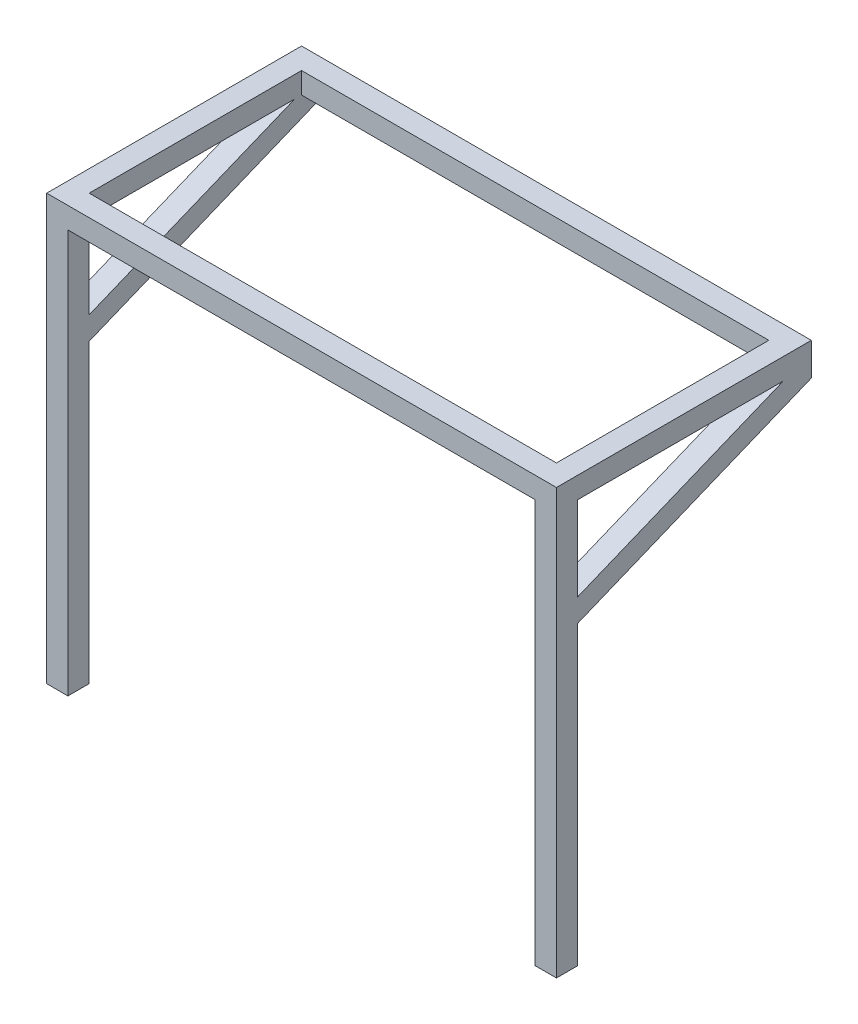
ISO-10303-21;
HEADER;
FILE_DESCRIPTION(('STEP AP214'),'2;1');
FILE_NAME('part.step','',(''),(''),'','','');
FILE_SCHEMA(('AUTOMOTIVE_DESIGN { 1 0 10303 214 1 1 1 1 }'));
ENDSEC;
DATA;
#1=APPLICATION_CONTEXT('core data for automotive mechanical design processes');
#2=APPLICATION_PROTOCOL_DEFINITION('international standard','automotive_design',2000,#1);
#3=PRODUCT_CONTEXT('',#1,'mechanical');
#4=PRODUCT('Part','Part','',(#3));
#5=PRODUCT_RELATED_PRODUCT_CATEGORY('part','',(#4));
#6=PRODUCT_DEFINITION_FORMATION('','',#4);
#7=PRODUCT_DEFINITION_CONTEXT('part definition',#1,'design');
#8=PRODUCT_DEFINITION('design','',#6,#7);
#9=PRODUCT_DEFINITION_SHAPE('','',#8);
#10=(LENGTH_UNIT() NAMED_UNIT(*) SI_UNIT(.MILLI.,.METRE.));
#11=(NAMED_UNIT(*) PLANE_ANGLE_UNIT() SI_UNIT($,.RADIAN.));
#12=(NAMED_UNIT(*) SI_UNIT($,.STERADIAN.) SOLID_ANGLE_UNIT());
#13=UNCERTAINTY_MEASURE_WITH_UNIT(LENGTH_MEASURE(1.E-05),#10,'distance_accuracy_value','');
#14=(GEOMETRIC_REPRESENTATION_CONTEXT(3) GLOBAL_UNCERTAINTY_ASSIGNED_CONTEXT((#13)) GLOBAL_UNIT_ASSIGNED_CONTEXT((#10,
#11,#12)) REPRESENTATION_CONTEXT('',''));
#15=CARTESIAN_POINT('',(0.,0.,0.));
#16=DIRECTION('',(0.,0.,1.));
#17=DIRECTION('',(1.,0.,0.));
#18=AXIS2_PLACEMENT_3D('',#15,#16,#17);
#19=CARTESIAN_POINT('',(0.,228.6,0.));
#20=DIRECTION('',(0.,1.,0.));
#21=DIRECTION('',(0.,0.,1.));
#22=AXIS2_PLACEMENT_3D('',#19,#20,#21);
#23=PLANE('',#22);
#24=DIRECTION('',(0.,0.,-1.));
#25=VECTOR('',#24,1.);
#26=CARTESIAN_POINT('',(0.,228.6,0.));
#27=LINE('',#26,#25);
#28=CARTESIAN_POINT('',(0.,228.6,-25.3999999999999));
#29=VERTEX_POINT('',#28);
#30=CARTESIAN_POINT('',(0.,228.6,-271.258271796698));
#31=VERTEX_POINT('',#30);
#32=EDGE_CURVE('E94',#29,#31,#27,.T.);
#33=ORIENTED_EDGE('',*,*,#32,.T.);
#34=DIRECTION('',(-1.,0.,0.));
#35=VECTOR('',#34,1.);
#36=CARTESIAN_POINT('',(25.4,228.6,-271.258271796698));
#37=LINE('',#36,#35);
#38=CARTESIAN_POINT('',(25.4,228.6,-271.258271796698));
#39=VERTEX_POINT('',#38);
#40=EDGE_CURVE('E250',#39,#31,#37,.T.);
#41=ORIENTED_EDGE('',*,*,#40,.F.);
#42=DIRECTION('',(0.,0.,-1.));
#43=VECTOR('',#42,1.);
#44=CARTESIAN_POINT('',(25.4,228.6,0.));
#45=LINE('',#44,#43);
#46=CARTESIAN_POINT('',(25.4,228.6,-25.3999999999999));
#47=VERTEX_POINT('',#46);
#48=EDGE_CURVE('E307',#47,#39,#45,.T.);
#49=ORIENTED_EDGE('',*,*,#48,.F.);
#50=DIRECTION('',(-1.,0.,0.));
#51=VECTOR('',#50,1.);
#52=CARTESIAN_POINT('',(0.,228.6,-25.3999999999999));
#53=LINE('',#52,#51);
#54=EDGE_CURVE('E310',#47,#29,#53,.T.);
#55=ORIENTED_EDGE('',*,*,#54,.T.);
#56=EDGE_LOOP('',(#33,#41,#49,#55));
#57=FACE_BOUND('',#56,.T.);
#58=ADVANCED_FACE('F71',(#57),#23,.F.);
#59=CARTESIAN_POINT('',(0.,254.,-25.3999999999999));
#60=DIRECTION('',(0.,0.,-1.));
#61=DIRECTION('',(-1.,0.,0.));
#62=AXIS2_PLACEMENT_3D('',#59,#60,#61);
#63=PLANE('',#62);
#64=DIRECTION('',(-1.,0.,0.));
#65=VECTOR('',#64,1.);
#66=CARTESIAN_POINT('',(25.4,128.021616083169,-25.4));
#67=LINE('',#66,#65);
#68=CARTESIAN_POINT('',(25.4,128.021616083169,-25.4));
#69=VERTEX_POINT('',#68);
#70=CARTESIAN_POINT('',(0.,128.021616083169,-25.4));
#71=VERTEX_POINT('',#70);
#72=EDGE_CURVE('E253',#69,#71,#67,.T.);
#73=ORIENTED_EDGE('',*,*,#72,.T.);
#74=DIRECTION('',(0.,-1.,0.));
#75=VECTOR('',#74,1.);
#76=CARTESIAN_POINT('',(0.,254.,-25.3999999999999));
#77=LINE('',#76,#75);
#78=EDGE_CURVE('E381',#29,#71,#77,.T.);
#79=ORIENTED_EDGE('',*,*,#78,.F.);
#80=ORIENTED_EDGE('',*,*,#54,.F.);
#81=DIRECTION('',(0.,-1.,0.));
#82=VECTOR('',#81,1.);
#83=CARTESIAN_POINT('',(25.4,254.,-25.3999999999999));
#84=LINE('',#83,#82);
#85=EDGE_CURVE('E385',#47,#69,#84,.T.);
#86=ORIENTED_EDGE('',*,*,#85,.T.);
#87=EDGE_LOOP('',(#73,#79,#80,#86));
#88=FACE_BOUND('',#87,.T.);
#89=ADVANCED_FACE('F439',(#88),#63,.T.);
#90=DIRECTION('',(0.,-1.,0.));
#91=VECTOR('',#90,1.);
#92=CARTESIAN_POINT('',(609.6,254.,-25.4));
#93=LINE('',#92,#91);
#94=CARTESIAN_POINT('',(609.6,228.6,-25.3999999999999));
#95=VERTEX_POINT('',#94);
#96=CARTESIAN_POINT('',(609.6,128.021616083169,-25.4));
#97=VERTEX_POINT('',#96);
#98=EDGE_CURVE('E341',#95,#97,#93,.T.);
#99=ORIENTED_EDGE('',*,*,#98,.T.);
#100=DIRECTION('',(1.,0.,0.));
#101=VECTOR('',#100,1.);
#102=CARTESIAN_POINT('',(584.2,128.021616083169,-25.4));
#103=LINE('',#102,#101);
#104=CARTESIAN_POINT('',(584.2,128.021616083169,-25.4));
#105=VERTEX_POINT('',#104);
#106=EDGE_CURVE('E277',#105,#97,#103,.T.);
#107=ORIENTED_EDGE('',*,*,#106,.F.);
#108=DIRECTION('',(0.,-1.,0.));
#109=VECTOR('',#108,1.);
#110=CARTESIAN_POINT('',(584.2,254.,-25.4));
#111=LINE('',#110,#109);
#112=CARTESIAN_POINT('',(584.2,228.6,-25.4));
#113=VERTEX_POINT('',#112);
#114=EDGE_CURVE('E337',#113,#105,#111,.T.);
#115=ORIENTED_EDGE('',*,*,#114,.F.);
#116=DIRECTION('',(1.,0.,0.));
#117=VECTOR('',#116,1.);
#118=CARTESIAN_POINT('',(0.,228.6,-25.3999999999999));
#119=LINE('',#118,#117);
#120=EDGE_CURVE('E315',#113,#95,#119,.T.);
#121=ORIENTED_EDGE('',*,*,#120,.T.);
#122=EDGE_LOOP('',(#99,#107,#115,#121));
#123=FACE_BOUND('',#122,.T.);
#124=ADVANCED_FACE('F455',(#123),#63,.T.);
#125=DIRECTION('',(1.,0.,0.));
#126=VECTOR('',#125,1.);
#127=CARTESIAN_POINT('',(584.2,228.6,-271.258271796698));
#128=LINE('',#127,#126);
#129=CARTESIAN_POINT('',(584.2,228.6,-271.258271796698));
#130=VERTEX_POINT('',#129);
#131=CARTESIAN_POINT('',(609.6,228.6,-271.258271796698));
#132=VERTEX_POINT('',#131);
#133=EDGE_CURVE('E266',#130,#132,#128,.T.);
#134=ORIENTED_EDGE('',*,*,#133,.T.);
#135=DIRECTION('',(0.,0.,-1.));
#136=VECTOR('',#135,1.);
#137=CARTESIAN_POINT('',(609.6,228.6,0.));
#138=LINE('',#137,#136);
#139=EDGE_CURVE('E225',#95,#132,#138,.T.);
#140=ORIENTED_EDGE('',*,*,#139,.F.);
#141=ORIENTED_EDGE('',*,*,#120,.F.);
#142=DIRECTION('',(0.,0.,-1.));
#143=VECTOR('',#142,1.);
#144=CARTESIAN_POINT('',(584.2,228.6,0.));
#145=LINE('',#144,#143);
#146=EDGE_CURVE('E297',#113,#130,#145,.T.);
#147=ORIENTED_EDGE('',*,*,#146,.T.);
#148=EDGE_LOOP('',(#134,#140,#141,#147));
#149=FACE_BOUND('',#148,.T.);
#150=ADVANCED_FACE('F451',(#149),#23,.F.);
#151=DIRECTION('',(1.,0.,0.));
#152=VECTOR('',#151,1.);
#153=CARTESIAN_POINT('',(0.,228.6,-279.4));
#154=LINE('',#153,#152);
#155=CARTESIAN_POINT('',(25.4,228.6,-279.4));
#156=VERTEX_POINT('',#155);
#157=CARTESIAN_POINT('',(584.2,228.6,-279.4));
#158=VERTEX_POINT('',#157);
#159=EDGE_CURVE('E232',#156,#158,#154,.T.);
#160=ORIENTED_EDGE('',*,*,#159,.F.);
#161=DIRECTION('',(0.,0.,-1.));
#162=VECTOR('',#161,1.);
#163=CARTESIAN_POINT('',(25.4,228.6,-304.8));
#164=LINE('',#163,#162);
#165=CARTESIAN_POINT('',(25.4,228.6,-304.8));
#166=VERTEX_POINT('',#165);
#167=EDGE_CURVE('E229',#156,#166,#164,.T.);
#168=ORIENTED_EDGE('',*,*,#167,.T.);
#169=DIRECTION('',(1.,0.,0.));
#170=VECTOR('',#169,1.);
#171=CARTESIAN_POINT('',(0.,228.6,-304.8));
#172=LINE('',#171,#170);
#173=CARTESIAN_POINT('',(584.2,228.6,-304.8));
#174=VERTEX_POINT('',#173);
#175=EDGE_CURVE('E215',#166,#174,#172,.T.);
#176=ORIENTED_EDGE('',*,*,#175,.T.);
#177=DIRECTION('',(0.,0.,-1.));
#178=VECTOR('',#177,1.);
#179=CARTESIAN_POINT('',(584.2,228.6,0.));
#180=LINE('',#179,#178);
#181=EDGE_CURVE('E12',#158,#174,#180,.T.);
#182=ORIENTED_EDGE('',*,*,#181,.F.);
#183=EDGE_LOOP('',(#160,#168,#176,#182));
#184=FACE_BOUND('',#183,.T.);
#185=ADVANCED_FACE('F230',(#184),#23,.F.);
#186=DIRECTION('',(-1.,0.,0.));
#187=VECTOR('',#186,1.);
#188=CARTESIAN_POINT('',(25.4,100.578383916831,-25.4));
#189=LINE('',#188,#187);
#190=CARTESIAN_POINT('',(25.4,100.578383916831,-25.4));
#191=VERTEX_POINT('',#190);
#192=CARTESIAN_POINT('',(0.,100.578383916831,-25.3999999999999));
#193=VERTEX_POINT('',#192);
#194=EDGE_CURVE('E256',#191,#193,#189,.T.);
#195=ORIENTED_EDGE('',*,*,#194,.F.);
#196=CARTESIAN_POINT('',(25.4,-254.,-25.3999999999999));
#197=VERTEX_POINT('',#196);
#198=EDGE_CURVE('E384',#191,#197,#84,.T.);
#199=ORIENTED_EDGE('',*,*,#198,.T.);
#200=DIRECTION('',(1.,0.,0.));
#201=VECTOR('',#200,1.);
#202=CARTESIAN_POINT('',(0.,-254.,-25.3999999999999));
#203=LINE('',#202,#201);
#204=CARTESIAN_POINT('',(0.,-254.,-25.3999999999999));
#205=VERTEX_POINT('',#204);
#206=EDGE_CURVE('E374',#205,#197,#203,.T.);
#207=ORIENTED_EDGE('',*,*,#206,.F.);
#208=EDGE_CURVE('E380',#193,#205,#77,.T.);
#209=ORIENTED_EDGE('',*,*,#208,.F.);
#210=EDGE_LOOP('',(#195,#199,#207,#209));
#211=FACE_BOUND('',#210,.T.);
#212=ADVANCED_FACE('F405',(#211),#63,.T.);
#213=DIRECTION('',(0.,1.,0.));
#214=VECTOR('',#213,1.);
#215=CARTESIAN_POINT('',(25.4,228.6,-25.3999999999999));
#216=LINE('',#215,#214);
#217=CARTESIAN_POINT('',(25.4,254.,-25.3999999999999));
#218=VERTEX_POINT('',#217);
#219=EDGE_CURVE('E292',#47,#218,#216,.T.);
#220=ORIENTED_EDGE('',*,*,#219,.T.);
#221=DIRECTION('',(1.,0.,0.));
#222=VECTOR('',#221,1.);
#223=CARTESIAN_POINT('',(0.,254.,-25.3999999999999));
#224=LINE('',#223,#222);
#225=CARTESIAN_POINT('',(584.2,254.,-25.3999999999999));
#226=VERTEX_POINT('',#225);
#227=EDGE_CURVE('E363',#218,#226,#224,.T.);
#228=ORIENTED_EDGE('',*,*,#227,.T.);
#229=DIRECTION('',(0.,1.,0.));
#230=VECTOR('',#229,1.);
#231=CARTESIAN_POINT('',(584.2,228.6,-25.3999999999999));
#232=LINE('',#231,#230);
#233=EDGE_CURVE('E273',#113,#226,#232,.T.);
#234=ORIENTED_EDGE('',*,*,#233,.F.);
#235=DIRECTION('',(1.,0.,0.));
#236=VECTOR('',#235,1.);
#237=CARTESIAN_POINT('',(25.4,228.6,-25.4));
#238=LINE('',#237,#236);
#239=EDGE_CURVE('E348',#47,#113,#238,.T.);
#240=ORIENTED_EDGE('',*,*,#239,.F.);
#241=EDGE_LOOP('',(#220,#228,#234,#240));
#242=FACE_BOUND('',#241,.T.);
#243=ADVANCED_FACE('F433',(#242),#63,.T.);
#244=DIRECTION('',(1.,0.,0.));
#245=VECTOR('',#244,1.);
#246=CARTESIAN_POINT('',(584.2,100.578383916831,-25.4));
#247=LINE('',#246,#245);
#248=CARTESIAN_POINT('',(584.2,100.578383916831,-25.4));
#249=VERTEX_POINT('',#248);
#250=CARTESIAN_POINT('',(609.6,100.578383916831,-25.4));
#251=VERTEX_POINT('',#250);
#252=EDGE_CURVE('E274',#249,#251,#247,.T.);
#253=ORIENTED_EDGE('',*,*,#252,.T.);
#254=CARTESIAN_POINT('',(609.6,-254.,-25.4));
#255=VERTEX_POINT('',#254);
#256=EDGE_CURVE('E340',#251,#255,#93,.T.);
#257=ORIENTED_EDGE('',*,*,#256,.T.);
#258=DIRECTION('',(-1.,0.,0.));
#259=VECTOR('',#258,1.);
#260=CARTESIAN_POINT('',(0.,-254.,-25.4000000000001));
#261=LINE('',#260,#259);
#262=CARTESIAN_POINT('',(584.2,-254.,-25.4));
#263=VERTEX_POINT('',#262);
#264=EDGE_CURVE('E327',#255,#263,#261,.T.);
#265=ORIENTED_EDGE('',*,*,#264,.T.);
#266=EDGE_CURVE('E326',#249,#263,#111,.T.);
#267=ORIENTED_EDGE('',*,*,#266,.F.);
#268=EDGE_LOOP('',(#253,#257,#265,#267));
#269=FACE_BOUND('',#268,.T.);
#270=ADVANCED_FACE('F563',(#269),#63,.T.);
#271=CARTESIAN_POINT('',(25.4,254.,0.));
#272=DIRECTION('',(-1.,0.,0.));
#273=DIRECTION('',(0.,0.,1.));
#274=AXIS2_PLACEMENT_3D('',#271,#272,#273);
#275=PLANE('',#274);
#276=DIRECTION('',(0.,0.,-1.));
#277=VECTOR('',#276,1.);
#278=CARTESIAN_POINT('',(25.4,228.6,0.));
#279=LINE('',#278,#277);
#280=CARTESIAN_POINT('',(25.4,228.6,0.));
#281=VERTEX_POINT('',#280);
#282=EDGE_CURVE('E357',#281,#47,#279,.T.);
#283=ORIENTED_EDGE('',*,*,#282,.F.);
#284=DIRECTION('',(0.,-1.,0.));
#285=VECTOR('',#284,1.);
#286=CARTESIAN_POINT('',(25.4,254.,0.));
#287=LINE('',#286,#285);
#288=CARTESIAN_POINT('',(25.4,-254.,0.));
#289=VERTEX_POINT('',#288);
#290=EDGE_CURVE('E79',#281,#289,#287,.T.);
#291=ORIENTED_EDGE('',*,*,#290,.T.);
#292=DIRECTION('',(0.,0.,-1.));
#293=VECTOR('',#292,1.);
#294=CARTESIAN_POINT('',(25.4,-254.,0.));
#295=LINE('',#294,#293);
#296=EDGE_CURVE('E371',#289,#197,#295,.T.);
#297=ORIENTED_EDGE('',*,*,#296,.T.);
#298=ORIENTED_EDGE('',*,*,#198,.F.);
#299=DIRECTION('',(0.,-0.378632845720504,0.925546956205677));
#300=VECTOR('',#299,1.);
#301=CARTESIAN_POINT('',(25.4,100.578383916831,-25.4));
#302=LINE('',#301,#300);
#303=CARTESIAN_POINT('',(25.4,214.878383916831,-304.8));
#304=VERTEX_POINT('',#303);
#305=EDGE_CURVE('E239',#304,#191,#302,.T.);
#306=ORIENTED_EDGE('',*,*,#305,.F.);
#307=DIRECTION('',(0.,-1.,0.));
#308=VECTOR('',#307,1.);
#309=CARTESIAN_POINT('',(25.4,214.878383916831,-304.8));
#310=LINE('',#309,#308);
#311=EDGE_CURVE('E221',#166,#304,#310,.T.);
#312=ORIENTED_EDGE('',*,*,#311,.F.);
#313=ORIENTED_EDGE('',*,*,#167,.F.);
#314=DIRECTION('',(0.,1.,0.));
#315=VECTOR('',#314,1.);
#316=CARTESIAN_POINT('',(25.4,228.6,-279.4));
#317=LINE('',#316,#315);
#318=CARTESIAN_POINT('',(25.4,254.,-279.4));
#319=VERTEX_POINT('',#318);
#320=EDGE_CURVE('E288',#156,#319,#317,.T.);
#321=ORIENTED_EDGE('',*,*,#320,.T.);
#322=DIRECTION('',(0.,0.,-1.));
#323=VECTOR('',#322,1.);
#324=CARTESIAN_POINT('',(25.4,254.,0.));
#325=LINE('',#324,#323);
#326=EDGE_CURVE('E296',#218,#319,#325,.T.);
#327=ORIENTED_EDGE('',*,*,#326,.F.);
#328=ORIENTED_EDGE('',*,*,#219,.F.);
#329=ORIENTED_EDGE('',*,*,#48,.T.);
#330=DIRECTION('',(0.,0.378632845720504,-0.925546956205677));
#331=VECTOR('',#330,1.);
#332=CARTESIAN_POINT('',(25.4,228.6,-271.258271796698));
#333=LINE('',#332,#331);
#334=EDGE_CURVE('E241',#69,#39,#333,.T.);
#335=ORIENTED_EDGE('',*,*,#334,.F.);
#336=ORIENTED_EDGE('',*,*,#85,.F.);
#337=EDGE_LOOP('',(#283,#291,#297,#298,#306,#312,#313,#321,#327,#328,#329,#335,#336));
#338=FACE_BOUND('',#337,.T.);
#339=ADVANCED_FACE('F237',(#338),#275,.F.);
#340=CARTESIAN_POINT('',(0.,254.,0.));
#341=DIRECTION('',(0.,0.,-1.));
#342=DIRECTION('',(-1.,0.,0.));
#343=AXIS2_PLACEMENT_3D('',#340,#341,#342);
#344=PLANE('',#343);
#345=DIRECTION('',(1.,0.,0.));
#346=VECTOR('',#345,1.);
#347=CARTESIAN_POINT('',(0.,-254.,0.));
#348=LINE('',#347,#346);
#349=CARTESIAN_POINT('',(0.,-254.,0.));
#350=VERTEX_POINT('',#349);
#351=EDGE_CURVE('E360',#350,#289,#348,.T.);
#352=ORIENTED_EDGE('',*,*,#351,.T.);
#353=ORIENTED_EDGE('',*,*,#290,.F.);
#354=DIRECTION('',(1.,0.,0.));
#355=VECTOR('',#354,1.);
#356=CARTESIAN_POINT('',(25.4,228.6,0.));
#357=LINE('',#356,#355);
#358=CARTESIAN_POINT('',(584.2,228.6,0.));
#359=VERTEX_POINT('',#358);
#360=EDGE_CURVE('E354',#281,#359,#357,.T.);
#361=ORIENTED_EDGE('',*,*,#360,.T.);
#362=DIRECTION('',(0.,-1.,0.));
#363=VECTOR('',#362,1.);
#364=CARTESIAN_POINT('',(584.2,254.,0.));
#365=LINE('',#364,#363);
#366=CARTESIAN_POINT('',(584.2,-254.,0.));
#367=VERTEX_POINT('',#366);
#368=EDGE_CURVE('E346',#359,#367,#365,.T.);
#369=ORIENTED_EDGE('',*,*,#368,.T.);
#370=DIRECTION('',(1.,0.,0.));
#371=VECTOR('',#370,1.);
#372=CARTESIAN_POINT('',(0.,-254.,0.));
#373=LINE('',#372,#371);
#374=CARTESIAN_POINT('',(609.6,-254.,0.));
#375=VERTEX_POINT('',#374);
#376=EDGE_CURVE('E330',#367,#375,#373,.T.);
#377=ORIENTED_EDGE('',*,*,#376,.T.);
#378=DIRECTION('',(0.,-1.,0.));
#379=VECTOR('',#378,1.);
#380=CARTESIAN_POINT('',(609.6,254.,0.));
#381=LINE('',#380,#379);
#382=CARTESIAN_POINT('',(609.6,254.,0.));
#383=VERTEX_POINT('',#382);
#384=EDGE_CURVE('E343',#383,#375,#381,.T.);
#385=ORIENTED_EDGE('',*,*,#384,.F.);
#386=DIRECTION('',(1.,0.,0.));
#387=VECTOR('',#386,1.);
#388=CARTESIAN_POINT('',(0.,254.,0.));
#389=LINE('',#388,#387);
#390=CARTESIAN_POINT('',(0.,254.,0.));
#391=VERTEX_POINT('',#390);
#392=EDGE_CURVE('E361',#391,#383,#389,.T.);
#393=ORIENTED_EDGE('',*,*,#392,.F.);
#394=DIRECTION('',(0.,-1.,0.));
#395=VECTOR('',#394,1.);
#396=CARTESIAN_POINT('',(0.,254.,0.));
#397=LINE('',#396,#395);
#398=EDGE_CURVE('E368',#391,#350,#397,.T.);
#399=ORIENTED_EDGE('',*,*,#398,.T.);
#400=EDGE_LOOP('',(#352,#353,#361,#369,#377,#385,#393,#399));
#401=FACE_BOUND('',#400,.T.);
#402=ADVANCED_FACE('F73',(#401),#344,.F.);
#403=CARTESIAN_POINT('',(0.,254.,0.));
#404=DIRECTION('',(-1.,0.,0.));
#405=DIRECTION('',(0.,0.,1.));
#406=AXIS2_PLACEMENT_3D('',#403,#404,#405);
#407=PLANE('',#406);
#408=DIRECTION('',(0.,1.,0.));
#409=VECTOR('',#408,1.);
#410=CARTESIAN_POINT('',(0.,228.6,-304.8));
#411=LINE('',#410,#409);
#412=CARTESIAN_POINT('',(0.,214.878383916831,-304.8));
#413=VERTEX_POINT('',#412);
#414=CARTESIAN_POINT('',(0.,254.,-304.8));
#415=VERTEX_POINT('',#414);
#416=EDGE_CURVE('E285',#413,#415,#411,.T.);
#417=ORIENTED_EDGE('',*,*,#416,.F.);
#418=DIRECTION('',(0.,-0.378632845720504,0.925546956205677));
#419=VECTOR('',#418,1.);
#420=CARTESIAN_POINT('',(0.,100.578383916831,-25.4));
#421=LINE('',#420,#419);
#422=EDGE_CURVE('E86',#413,#193,#421,.T.);
#423=ORIENTED_EDGE('',*,*,#422,.T.);
#424=ORIENTED_EDGE('',*,*,#208,.T.);
#425=DIRECTION('',(0.,0.,-1.));
#426=VECTOR('',#425,1.);
#427=CARTESIAN_POINT('',(0.,-254.,0.));
#428=LINE('',#427,#426);
#429=EDGE_CURVE('E364',#350,#205,#428,.T.);
#430=ORIENTED_EDGE('',*,*,#429,.F.);
#431=ORIENTED_EDGE('',*,*,#398,.F.);
#432=DIRECTION('',(0.,0.,-1.));
#433=VECTOR('',#432,1.);
#434=CARTESIAN_POINT('',(0.,254.,0.));
#435=LINE('',#434,#433);
#436=EDGE_CURVE('E366',#391,#415,#435,.T.);
#437=ORIENTED_EDGE('',*,*,#436,.T.);
#438=EDGE_LOOP('',(#417,#423,#424,#430,#431,#437));
#439=FACE_BOUND('',#438,.T.);
#440=DIRECTION('',(0.,0.378632845720504,-0.925546956205677));
#441=VECTOR('',#440,1.);
#442=CARTESIAN_POINT('',(0.,228.6,-271.258271796698));
#443=LINE('',#442,#441);
#444=EDGE_CURVE('E234',#71,#31,#443,.T.);
#445=ORIENTED_EDGE('',*,*,#444,.T.);
#446=ORIENTED_EDGE('',*,*,#32,.F.);
#447=ORIENTED_EDGE('',*,*,#78,.T.);
#448=EDGE_LOOP('',(#445,#446,#447));
#449=FACE_BOUND('',#448,.T.);
#450=ADVANCED_FACE('F400',(#439,#449),#407,.T.);
#451=CARTESIAN_POINT('',(0.,254.,0.));
#452=DIRECTION('',(0.,1.,0.));
#453=DIRECTION('',(0.,0.,1.));
#454=AXIS2_PLACEMENT_3D('',#451,#452,#453);
#455=PLANE('',#454);
#456=ORIENTED_EDGE('',*,*,#227,.F.);
#457=ORIENTED_EDGE('',*,*,#326,.T.);
#458=DIRECTION('',(1.,0.,0.));
#459=VECTOR('',#458,1.);
#460=CARTESIAN_POINT('',(0.,254.,-279.4));
#461=LINE('',#460,#459);
#462=CARTESIAN_POINT('',(584.2,254.,-279.4));
#463=VERTEX_POINT('',#462);
#464=EDGE_CURVE('E293',#319,#463,#461,.T.);
#465=ORIENTED_EDGE('',*,*,#464,.T.);
#466=DIRECTION('',(0.,0.,-1.));
#467=VECTOR('',#466,1.);
#468=CARTESIAN_POINT('',(584.2,254.,0.));
#469=LINE('',#468,#467);
#470=EDGE_CURVE('E302',#226,#463,#469,.T.);
#471=ORIENTED_EDGE('',*,*,#470,.F.);
#472=EDGE_LOOP('',(#456,#457,#465,#471));
#473=FACE_BOUND('',#472,.T.);
#474=ORIENTED_EDGE('',*,*,#392,.T.);
#475=DIRECTION('',(0.,0.,-1.));
#476=VECTOR('',#475,1.);
#477=CARTESIAN_POINT('',(609.6,254.,0.));
#478=LINE('',#477,#476);
#479=CARTESIAN_POINT('',(609.6,254.,-304.8));
#480=VERTEX_POINT('',#479);
#481=EDGE_CURVE('E324',#383,#480,#478,.T.);
#482=ORIENTED_EDGE('',*,*,#481,.T.);
#483=DIRECTION('',(1.,0.,0.));
#484=VECTOR('',#483,1.);
#485=CARTESIAN_POINT('',(0.,254.,-304.8));
#486=LINE('',#485,#484);
#487=EDGE_CURVE('E300',#415,#480,#486,.T.);
#488=ORIENTED_EDGE('',*,*,#487,.F.);
#489=ORIENTED_EDGE('',*,*,#436,.F.);
#490=EDGE_LOOP('',(#474,#482,#488,#489));
#491=FACE_BOUND('',#490,.T.);
#492=ADVANCED_FACE('F410',(#473,#491),#455,.T.);
#493=CARTESIAN_POINT('',(0.,-254.,0.));
#494=DIRECTION('',(0.,1.,0.));
#495=DIRECTION('',(0.,0.,1.));
#496=AXIS2_PLACEMENT_3D('',#493,#494,#495);
#497=PLANE('',#496);
#498=ORIENTED_EDGE('',*,*,#351,.F.);
#499=ORIENTED_EDGE('',*,*,#429,.T.);
#500=ORIENTED_EDGE('',*,*,#206,.T.);
#501=ORIENTED_EDGE('',*,*,#296,.F.);
#502=EDGE_LOOP('',(#498,#499,#500,#501));
#503=FACE_BOUND('',#502,.T.);
#504=ADVANCED_FACE('F394',(#503),#497,.F.);
#505=CARTESIAN_POINT('',(0.,228.6,0.));
#506=DIRECTION('',(0.,1.,0.));
#507=DIRECTION('',(0.,0.,1.));
#508=AXIS2_PLACEMENT_3D('',#505,#506,#507);
#509=PLANE('',#508);
#510=ORIENTED_EDGE('',*,*,#239,.T.);
#511=DIRECTION('',(0.,0.,-1.));
#512=VECTOR('',#511,1.);
#513=CARTESIAN_POINT('',(584.2,228.6,0.));
#514=LINE('',#513,#512);
#515=EDGE_CURVE('E351',#359,#113,#514,.T.);
#516=ORIENTED_EDGE('',*,*,#515,.F.);
#517=ORIENTED_EDGE('',*,*,#360,.F.);
#518=ORIENTED_EDGE('',*,*,#282,.T.);
#519=EDGE_LOOP('',(#510,#516,#517,#518));
#520=FACE_BOUND('',#519,.T.);
#521=ADVANCED_FACE('F499',(#520),#509,.F.);
#522=CARTESIAN_POINT('',(584.2,254.,0.));
#523=DIRECTION('',(-1.,0.,0.));
#524=DIRECTION('',(0.,0.,1.));
#525=AXIS2_PLACEMENT_3D('',#522,#523,#524);
#526=PLANE('',#525);
#527=ORIENTED_EDGE('',*,*,#368,.F.);
#528=ORIENTED_EDGE('',*,*,#515,.T.);
#529=ORIENTED_EDGE('',*,*,#114,.T.);
#530=DIRECTION('',(0.,0.378632845720504,-0.925546956205677));
#531=VECTOR('',#530,1.);
#532=CARTESIAN_POINT('',(584.2,100.766835724343,41.2227964326858));
#533=LINE('',#532,#531);
#534=EDGE_CURVE('E260',#105,#130,#533,.T.);
#535=ORIENTED_EDGE('',*,*,#534,.T.);
#536=ORIENTED_EDGE('',*,*,#146,.F.);
#537=ORIENTED_EDGE('',*,*,#233,.T.);
#538=ORIENTED_EDGE('',*,*,#470,.T.);
#539=DIRECTION('',(0.,1.,0.));
#540=VECTOR('',#539,1.);
#541=CARTESIAN_POINT('',(584.2,228.6,-279.4));
#542=LINE('',#541,#540);
#543=EDGE_CURVE('E290',#158,#463,#542,.T.);
#544=ORIENTED_EDGE('',*,*,#543,.F.);
#545=ORIENTED_EDGE('',*,*,#181,.T.);
#546=DIRECTION('',(0.,-1.,0.));
#547=VECTOR('',#546,1.);
#548=CARTESIAN_POINT('',(584.2,4.32492330053988E-13,-304.8));
#549=LINE('',#548,#547);
#550=CARTESIAN_POINT('',(584.2,214.878383916831,-304.8));
#551=VERTEX_POINT('',#550);
#552=EDGE_CURVE('E223',#174,#551,#549,.T.);
#553=ORIENTED_EDGE('',*,*,#552,.T.);
#554=DIRECTION('',(0.,0.378632845720504,-0.925546956205677));
#555=VECTOR('',#554,1.);
#556=CARTESIAN_POINT('',(584.2,77.2579430367189,31.605522151385));
#557=LINE('',#556,#555);
#558=EDGE_CURVE('E263',#249,#551,#557,.T.);
#559=ORIENTED_EDGE('',*,*,#558,.F.);
#560=ORIENTED_EDGE('',*,*,#266,.T.);
#561=DIRECTION('',(0.,0.,-1.));
#562=VECTOR('',#561,1.);
#563=CARTESIAN_POINT('',(584.2,-254.,0.));
#564=LINE('',#563,#562);
#565=EDGE_CURVE('E305',#367,#263,#564,.T.);
#566=ORIENTED_EDGE('',*,*,#565,.F.);
#567=EDGE_LOOP('',(#527,#528,#529,#535,#536,#537,#538,#544,#545,#553,#559,#560,#566));
#568=FACE_BOUND('',#567,.T.);
#569=ADVANCED_FACE('F421',(#568),#526,.T.);
#570=CARTESIAN_POINT('',(609.6,254.,0.));
#571=DIRECTION('',(-1.,0.,0.));
#572=DIRECTION('',(0.,0.,1.));
#573=AXIS2_PLACEMENT_3D('',#570,#571,#572);
#574=PLANE('',#573);
#575=DIRECTION('',(0.,0.378632845720504,-0.925546956205677));
#576=VECTOR('',#575,1.);
#577=CARTESIAN_POINT('',(609.6,100.766835724343,41.2227964326858));
#578=LINE('',#577,#576);
#579=EDGE_CURVE('E252',#97,#132,#578,.T.);
#580=ORIENTED_EDGE('',*,*,#579,.F.);
#581=ORIENTED_EDGE('',*,*,#98,.F.);
#582=ORIENTED_EDGE('',*,*,#139,.T.);
#583=EDGE_LOOP('',(#580,#581,#582));
#584=FACE_BOUND('',#583,.T.);
#585=DIRECTION('',(0.,0.,-1.));
#586=VECTOR('',#585,1.);
#587=CARTESIAN_POINT('',(609.6,-254.,0.));
#588=LINE('',#587,#586);
#589=EDGE_CURVE('E332',#375,#255,#588,.T.);
#590=ORIENTED_EDGE('',*,*,#589,.T.);
#591=ORIENTED_EDGE('',*,*,#256,.F.);
#592=DIRECTION('',(0.,0.378632845720504,-0.925546956205677));
#593=VECTOR('',#592,1.);
#594=CARTESIAN_POINT('',(609.6,77.2579430367189,31.605522151385));
#595=LINE('',#594,#593);
#596=CARTESIAN_POINT('',(609.6,214.878383916831,-304.8));
#597=VERTEX_POINT('',#596);
#598=EDGE_CURVE('E261',#251,#597,#595,.T.);
#599=ORIENTED_EDGE('',*,*,#598,.T.);
#600=DIRECTION('',(0.,1.,0.));
#601=VECTOR('',#600,1.);
#602=CARTESIAN_POINT('',(609.6,228.6,-304.8));
#603=LINE('',#602,#601);
#604=EDGE_CURVE('E282',#597,#480,#603,.T.);
#605=ORIENTED_EDGE('',*,*,#604,.T.);
#606=ORIENTED_EDGE('',*,*,#481,.F.);
#607=ORIENTED_EDGE('',*,*,#384,.T.);
#608=EDGE_LOOP('',(#590,#591,#599,#605,#606,#607));
#609=FACE_BOUND('',#608,.T.);
#610=ADVANCED_FACE('F413',(#584,#609),#574,.F.);
#611=CARTESIAN_POINT('',(0.,-254.,0.));
#612=DIRECTION('',(0.,1.,0.));
#613=DIRECTION('',(0.,0.,1.));
#614=AXIS2_PLACEMENT_3D('',#611,#612,#613);
#615=PLANE('',#614);
#616=ORIENTED_EDGE('',*,*,#565,.T.);
#617=ORIENTED_EDGE('',*,*,#264,.F.);
#618=ORIENTED_EDGE('',*,*,#589,.F.);
#619=ORIENTED_EDGE('',*,*,#376,.F.);
#620=EDGE_LOOP('',(#616,#617,#618,#619));
#621=FACE_BOUND('',#620,.T.);
#622=ADVANCED_FACE('F487',(#621),#615,.F.);
#623=CARTESIAN_POINT('',(0.,228.6,-279.4));
#624=DIRECTION('',(0.,0.,1.));
#625=DIRECTION('',(1.,0.,0.));
#626=AXIS2_PLACEMENT_3D('',#623,#624,#625);
#627=PLANE('',#626);
#628=ORIENTED_EDGE('',*,*,#464,.F.);
#629=ORIENTED_EDGE('',*,*,#320,.F.);
#630=ORIENTED_EDGE('',*,*,#159,.T.);
#631=ORIENTED_EDGE('',*,*,#543,.T.);
#632=EDGE_LOOP('',(#628,#629,#630,#631));
#633=FACE_BOUND('',#632,.T.);
#634=ADVANCED_FACE('F427',(#633),#627,.T.);
#635=CARTESIAN_POINT('',(0.,228.6,-304.8));
#636=DIRECTION('',(0.,0.,1.));
#637=DIRECTION('',(1.,0.,0.));
#638=AXIS2_PLACEMENT_3D('',#635,#636,#637);
#639=PLANE('',#638);
#640=ORIENTED_EDGE('',*,*,#487,.T.);
#641=ORIENTED_EDGE('',*,*,#604,.F.);
#642=DIRECTION('',(1.,0.,0.));
#643=VECTOR('',#642,1.);
#644=CARTESIAN_POINT('',(584.2,214.878383916831,-304.8));
#645=LINE('',#644,#643);
#646=EDGE_CURVE('E270',#551,#597,#645,.T.);
#647=ORIENTED_EDGE('',*,*,#646,.F.);
#648=ORIENTED_EDGE('',*,*,#552,.F.);
#649=ORIENTED_EDGE('',*,*,#175,.F.);
#650=ORIENTED_EDGE('',*,*,#311,.T.);
#651=DIRECTION('',(-1.,0.,0.));
#652=VECTOR('',#651,1.);
#653=CARTESIAN_POINT('',(25.4,214.878383916831,-304.8));
#654=LINE('',#653,#652);
#655=EDGE_CURVE('E246',#304,#413,#654,.T.);
#656=ORIENTED_EDGE('',*,*,#655,.T.);
#657=ORIENTED_EDGE('',*,*,#416,.T.);
#658=EDGE_LOOP('',(#640,#641,#647,#648,#649,#650,#656,#657));
#659=FACE_BOUND('',#658,.T.);
#660=ADVANCED_FACE('F218',(#659),#639,.F.);
#661=CARTESIAN_POINT('',(584.2,77.2579430367189,31.605522151385));
#662=DIRECTION('',(0.,-0.925546956205677,-0.378632845720504));
#663=DIRECTION('',(0.,0.378632845720504,-0.925546956205677));
#664=AXIS2_PLACEMENT_3D('',#661,#662,#663);
#665=PLANE('',#664);
#666=ORIENTED_EDGE('',*,*,#598,.F.);
#667=ORIENTED_EDGE('',*,*,#252,.F.);
#668=ORIENTED_EDGE('',*,*,#558,.T.);
#669=ORIENTED_EDGE('',*,*,#646,.T.);
#670=EDGE_LOOP('',(#666,#667,#668,#669));
#671=FACE_BOUND('',#670,.T.);
#672=ADVANCED_FACE('F416',(#671),#665,.T.);
#673=CARTESIAN_POINT('',(584.2,100.766835724343,41.2227964326858));
#674=DIRECTION('',(0.,-0.925546956205677,-0.378632845720504));
#675=DIRECTION('',(0.,0.378632845720504,-0.925546956205677));
#676=AXIS2_PLACEMENT_3D('',#673,#674,#675);
#677=PLANE('',#676);
#678=ORIENTED_EDGE('',*,*,#579,.T.);
#679=ORIENTED_EDGE('',*,*,#133,.F.);
#680=ORIENTED_EDGE('',*,*,#534,.F.);
#681=ORIENTED_EDGE('',*,*,#106,.T.);
#682=EDGE_LOOP('',(#678,#679,#680,#681));
#683=FACE_BOUND('',#682,.T.);
#684=ADVANCED_FACE('F474',(#683),#677,.F.);
#685=CARTESIAN_POINT('',(25.4,228.6,-271.258271796698));
#686=DIRECTION('',(0.,0.925546956205677,0.378632845720504));
#687=DIRECTION('',(0.,-0.378632845720504,0.925546956205677));
#688=AXIS2_PLACEMENT_3D('',#685,#686,#687);
#689=PLANE('',#688);
#690=ORIENTED_EDGE('',*,*,#444,.F.);
#691=ORIENTED_EDGE('',*,*,#72,.F.);
#692=ORIENTED_EDGE('',*,*,#334,.T.);
#693=ORIENTED_EDGE('',*,*,#40,.T.);
#694=EDGE_LOOP('',(#690,#691,#692,#693));
#695=FACE_BOUND('',#694,.T.);
#696=ADVANCED_FACE('F437',(#695),#689,.T.);
#697=CARTESIAN_POINT('',(25.4,100.578383916831,-25.4));
#698=DIRECTION('',(0.,-0.925546956205677,-0.378632845720504));
#699=DIRECTION('',(0.,0.378632845720504,-0.925546956205677));
#700=AXIS2_PLACEMENT_3D('',#697,#698,#699);
#701=PLANE('',#700);
#702=ORIENTED_EDGE('',*,*,#422,.F.);
#703=ORIENTED_EDGE('',*,*,#655,.F.);
#704=ORIENTED_EDGE('',*,*,#305,.T.);
#705=ORIENTED_EDGE('',*,*,#194,.T.);
#706=EDGE_LOOP('',(#702,#703,#704,#705));
#707=FACE_BOUND('',#706,.T.);
#708=ADVANCED_FACE('F407',(#707),#701,.T.);
#709=CLOSED_SHELL('',(#58,#89,#124,#150,#185,#212,#243,#270,#339,#402,#450,#492,#504,#521,#569,
#610,#622,#634,#660,#672,#684,#696,#708));
#710=MANIFOLD_SOLID_BREP('B2',#709);
#711=ADVANCED_BREP_SHAPE_REPRESENTATION('',(#18,#710),#14);
#712=SHAPE_DEFINITION_REPRESENTATION(#9,#711);
ENDSEC;
END-ISO-10303-21;
